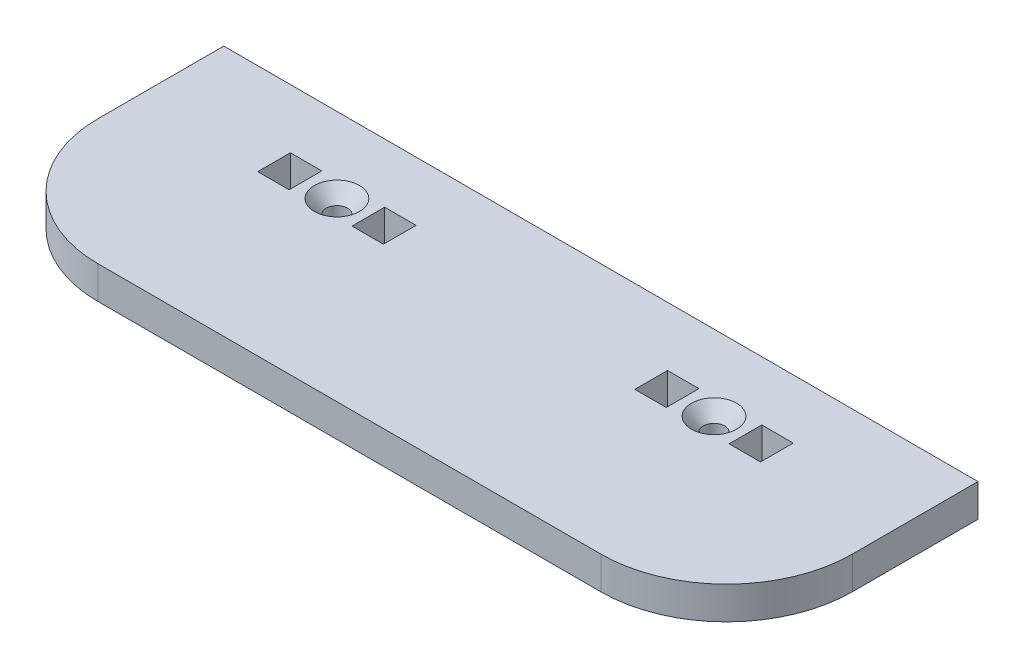
ISO-10303-21;
HEADER;
FILE_DESCRIPTION(('STEP AP214'),'2;1');
FILE_NAME('part.step','',(''),(''),'','','');
FILE_SCHEMA(('AUTOMOTIVE_DESIGN { 1 0 10303 214 1 1 1 1 }'));
ENDSEC;
DATA;
#1=APPLICATION_CONTEXT('core data for automotive mechanical design processes');
#2=APPLICATION_PROTOCOL_DEFINITION('international standard','automotive_design',2000,#1);
#3=PRODUCT_CONTEXT('',#1,'mechanical');
#4=PRODUCT('Part','Part','',(#3));
#5=PRODUCT_RELATED_PRODUCT_CATEGORY('part','',(#4));
#6=PRODUCT_DEFINITION_FORMATION('','',#4);
#7=PRODUCT_DEFINITION_CONTEXT('part definition',#1,'design');
#8=PRODUCT_DEFINITION('design','',#6,#7);
#9=PRODUCT_DEFINITION_SHAPE('','',#8);
#10=(LENGTH_UNIT() NAMED_UNIT(*) SI_UNIT(.MILLI.,.METRE.));
#11=(NAMED_UNIT(*) PLANE_ANGLE_UNIT() SI_UNIT($,.RADIAN.));
#12=(NAMED_UNIT(*) SI_UNIT($,.STERADIAN.) SOLID_ANGLE_UNIT());
#13=UNCERTAINTY_MEASURE_WITH_UNIT(LENGTH_MEASURE(1.E-05),#10,'distance_accuracy_value','');
#14=(GEOMETRIC_REPRESENTATION_CONTEXT(3) GLOBAL_UNCERTAINTY_ASSIGNED_CONTEXT((#13)) GLOBAL_UNIT_ASSIGNED_CONTEXT((#10,
#11,#12)) REPRESENTATION_CONTEXT('',''));
#15=CARTESIAN_POINT('',(0.,0.,0.));
#16=DIRECTION('',(0.,0.,1.));
#17=DIRECTION('',(1.,0.,0.));
#18=AXIS2_PLACEMENT_3D('',#15,#16,#17);
#19=CARTESIAN_POINT('',(-76.2,6.604,-25.4));
#20=DIRECTION('',(1.,0.,0.));
#21=DIRECTION('',(0.,0.,-1.));
#22=AXIS2_PLACEMENT_3D('',#19,#20,#21);
#23=PLANE('',#22);
#24=DIRECTION('',(0.,0.,1.));
#25=VECTOR('',#24,1.);
#26=CARTESIAN_POINT('',(-76.2,0.,-25.4));
#27=LINE('',#26,#25);
#28=CARTESIAN_POINT('',(-76.2,0.,-25.4));
#29=VERTEX_POINT('',#28);
#30=CARTESIAN_POINT('',(-76.2,0.,0.));
#31=VERTEX_POINT('',#30);
#32=EDGE_CURVE('E312',#29,#31,#27,.T.);
#33=ORIENTED_EDGE('',*,*,#32,.T.);
#34=DIRECTION('',(0.,-1.,0.));
#35=VECTOR('',#34,1.);
#36=CARTESIAN_POINT('',(-76.2,6.604,0.));
#37=LINE('',#36,#35);
#38=CARTESIAN_POINT('',(-76.2,6.604,0.));
#39=VERTEX_POINT('',#38);
#40=EDGE_CURVE('E11',#31,#39,#37,.F.);
#41=ORIENTED_EDGE('',*,*,#40,.T.);
#42=DIRECTION('',(0.,0.,1.));
#43=VECTOR('',#42,1.);
#44=CARTESIAN_POINT('',(-76.2,6.604,-25.4));
#45=LINE('',#44,#43);
#46=CARTESIAN_POINT('',(-76.2,6.604,-25.4));
#47=VERTEX_POINT('',#46);
#48=EDGE_CURVE('E319',#47,#39,#45,.T.);
#49=ORIENTED_EDGE('',*,*,#48,.F.);
#50=DIRECTION('',(0.,-1.,0.));
#51=VECTOR('',#50,1.);
#52=CARTESIAN_POINT('',(-76.2,6.604,-25.4));
#53=LINE('',#52,#51);
#54=EDGE_CURVE('E330',#47,#29,#53,.T.);
#55=ORIENTED_EDGE('',*,*,#54,.T.);
#56=EDGE_LOOP('',(#33,#41,#49,#55));
#57=FACE_BOUND('',#56,.T.);
#58=ADVANCED_FACE('F32',(#57),#23,.F.);
#59=CARTESIAN_POINT('',(-76.2,6.604,25.4));
#60=DIRECTION('',(0.,0.,-1.));
#61=DIRECTION('',(-1.,0.,0.));
#62=AXIS2_PLACEMENT_3D('',#59,#60,#61);
#63=PLANE('',#62);
#64=DIRECTION('',(1.,0.,0.));
#65=VECTOR('',#64,1.);
#66=CARTESIAN_POINT('',(-76.2,0.,25.4));
#67=LINE('',#66,#65);
#68=CARTESIAN_POINT('',(-50.8,0.,25.4));
#69=VERTEX_POINT('',#68);
#70=CARTESIAN_POINT('',(50.8,0.,25.4));
#71=VERTEX_POINT('',#70);
#72=EDGE_CURVE('E333',#69,#71,#67,.T.);
#73=ORIENTED_EDGE('',*,*,#72,.T.);
#74=DIRECTION('',(0.,-1.,0.));
#75=VECTOR('',#74,1.);
#76=CARTESIAN_POINT('',(50.8,6.604,25.4));
#77=LINE('',#76,#75);
#78=CARTESIAN_POINT('',(50.8,6.604,25.4));
#79=VERTEX_POINT('',#78);
#80=EDGE_CURVE('E354',#71,#79,#77,.F.);
#81=ORIENTED_EDGE('',*,*,#80,.T.);
#82=DIRECTION('',(1.,0.,0.));
#83=VECTOR('',#82,1.);
#84=CARTESIAN_POINT('',(-76.2,6.604,25.4));
#85=LINE('',#84,#83);
#86=CARTESIAN_POINT('',(-50.8,6.604,25.4));
#87=VERTEX_POINT('',#86);
#88=EDGE_CURVE('E322',#87,#79,#85,.T.);
#89=ORIENTED_EDGE('',*,*,#88,.F.);
#90=DIRECTION('',(0.,-1.,0.));
#91=VECTOR('',#90,1.);
#92=CARTESIAN_POINT('',(-50.8,6.604,25.4));
#93=LINE('',#92,#91);
#94=EDGE_CURVE('E351',#87,#69,#93,.T.);
#95=ORIENTED_EDGE('',*,*,#94,.T.);
#96=EDGE_LOOP('',(#73,#81,#89,#95));
#97=FACE_BOUND('',#96,.T.);
#98=ADVANCED_FACE('F375',(#97),#63,.F.);
#99=CARTESIAN_POINT('',(76.2,6.604,-25.4));
#100=DIRECTION('',(-1.,0.,0.));
#101=DIRECTION('',(0.,0.,1.));
#102=AXIS2_PLACEMENT_3D('',#99,#100,#101);
#103=PLANE('',#102);
#104=DIRECTION('',(0.,0.,-1.));
#105=VECTOR('',#104,1.);
#106=CARTESIAN_POINT('',(76.2,6.604,-25.4));
#107=LINE('',#106,#105);
#108=CARTESIAN_POINT('',(76.2,6.604,0.));
#109=VERTEX_POINT('',#108);
#110=CARTESIAN_POINT('',(76.2,6.604,-25.4));
#111=VERTEX_POINT('',#110);
#112=EDGE_CURVE('E326',#109,#111,#107,.T.);
#113=ORIENTED_EDGE('',*,*,#112,.F.);
#114=DIRECTION('',(0.,-1.,0.));
#115=VECTOR('',#114,1.);
#116=CARTESIAN_POINT('',(76.2,6.604,0.));
#117=LINE('',#116,#115);
#118=CARTESIAN_POINT('',(76.2,0.,0.));
#119=VERTEX_POINT('',#118);
#120=EDGE_CURVE('E344',#109,#119,#117,.T.);
#121=ORIENTED_EDGE('',*,*,#120,.T.);
#122=DIRECTION('',(0.,0.,-1.));
#123=VECTOR('',#122,1.);
#124=CARTESIAN_POINT('',(76.2,0.,-25.4));
#125=LINE('',#124,#123);
#126=CARTESIAN_POINT('',(76.2,0.,-25.4));
#127=VERTEX_POINT('',#126);
#128=EDGE_CURVE('E336',#119,#127,#125,.T.);
#129=ORIENTED_EDGE('',*,*,#128,.T.);
#130=DIRECTION('',(0.,-1.,0.));
#131=VECTOR('',#130,1.);
#132=CARTESIAN_POINT('',(76.2,6.604,-25.4));
#133=LINE('',#132,#131);
#134=EDGE_CURVE('E341',#111,#127,#133,.T.);
#135=ORIENTED_EDGE('',*,*,#134,.F.);
#136=EDGE_LOOP('',(#113,#121,#129,#135));
#137=FACE_BOUND('',#136,.T.);
#138=ADVANCED_FACE('F367',(#137),#103,.F.);
#139=CARTESIAN_POINT('',(-76.2,6.604,-25.4));
#140=DIRECTION('',(0.,0.,1.));
#141=DIRECTION('',(1.,0.,0.));
#142=AXIS2_PLACEMENT_3D('',#139,#140,#141);
#143=PLANE('',#142);
#144=DIRECTION('',(-1.,0.,0.));
#145=VECTOR('',#144,1.);
#146=CARTESIAN_POINT('',(-76.2,0.,-25.4));
#147=LINE('',#146,#145);
#148=EDGE_CURVE('E323',#127,#29,#147,.T.);
#149=ORIENTED_EDGE('',*,*,#148,.T.);
#150=ORIENTED_EDGE('',*,*,#54,.F.);
#151=DIRECTION('',(-1.,0.,0.));
#152=VECTOR('',#151,1.);
#153=CARTESIAN_POINT('',(-76.2,6.604,-25.4));
#154=LINE('',#153,#152);
#155=EDGE_CURVE('E328',#111,#47,#154,.T.);
#156=ORIENTED_EDGE('',*,*,#155,.F.);
#157=ORIENTED_EDGE('',*,*,#134,.T.);
#158=EDGE_LOOP('',(#149,#150,#156,#157));
#159=FACE_BOUND('',#158,.T.);
#160=ADVANCED_FACE('F385',(#159),#143,.F.);
#161=CARTESIAN_POINT('',(0.,6.604,0.));
#162=DIRECTION('',(0.,1.,0.));
#163=DIRECTION('',(0.,0.,1.));
#164=AXIS2_PLACEMENT_3D('',#161,#162,#163);
#165=PLANE('',#164);
#166=CARTESIAN_POINT('',(-38.1000000000001,6.604,-10.16));
#167=DIRECTION('',(0.,1.,0.));
#168=DIRECTION('',(0.,0.,1.));
#169=AXIS2_PLACEMENT_3D('',#166,#167,#168);
#170=CIRCLE('',#169,4.5593);
#171=CARTESIAN_POINT('',(-38.1000000000001,6.604,-5.6007));
#172=VERTEX_POINT('',#171);
#173=EDGE_CURVE('E494',#172,#172,#170,.T.);
#174=ORIENTED_EDGE('',*,*,#173,.F.);
#175=EDGE_LOOP('',(#174));
#176=FACE_BOUND('',#175,.T.);
#177=CARTESIAN_POINT('',(38.0999999999999,6.604,-10.16));
#178=DIRECTION('',(0.,1.,0.));
#179=DIRECTION('',(0.,0.,1.));
#180=AXIS2_PLACEMENT_3D('',#177,#178,#179);
#181=CIRCLE('',#180,4.5593);
#182=CARTESIAN_POINT('',(38.0999999999999,6.604,-5.6007));
#183=VERTEX_POINT('',#182);
#184=EDGE_CURVE('E496',#183,#183,#181,.T.);
#185=ORIENTED_EDGE('',*,*,#184,.F.);
#186=EDGE_LOOP('',(#185));
#187=FACE_BOUND('',#186,.T.);
#188=DIRECTION('',(0.,0.,1.));
#189=VECTOR('',#188,1.);
#190=CARTESIAN_POINT('',(25.3999999999999,6.604,-6.85799999999998));
#191=LINE('',#190,#189);
#192=CARTESIAN_POINT('',(25.4,6.604,-13.462));
#193=VERTEX_POINT('',#192);
#194=CARTESIAN_POINT('',(25.3999999999999,6.604,-6.85799999999998));
#195=VERTEX_POINT('',#194);
#196=EDGE_CURVE('E47',#193,#195,#191,.T.);
#197=ORIENTED_EDGE('',*,*,#196,.F.);
#198=DIRECTION('',(-1.,0.,0.));
#199=VECTOR('',#198,1.);
#200=CARTESIAN_POINT('',(25.4,6.604,-13.462));
#201=LINE('',#200,#199);
#202=CARTESIAN_POINT('',(31.75,6.604,-13.462));
#203=VERTEX_POINT('',#202);
#204=EDGE_CURVE('E198',#203,#193,#201,.T.);
#205=ORIENTED_EDGE('',*,*,#204,.F.);
#206=DIRECTION('',(0.,0.,-1.));
#207=VECTOR('',#206,1.);
#208=CARTESIAN_POINT('',(31.75,6.604,-13.462));
#209=LINE('',#208,#207);
#210=CARTESIAN_POINT('',(31.7499999999999,6.604,-6.858));
#211=VERTEX_POINT('',#210);
#212=EDGE_CURVE('E201',#211,#203,#209,.T.);
#213=ORIENTED_EDGE('',*,*,#212,.F.);
#214=DIRECTION('',(1.,0.,0.));
#215=VECTOR('',#214,1.);
#216=CARTESIAN_POINT('',(31.7499999999999,6.604,-6.858));
#217=LINE('',#216,#215);
#218=EDGE_CURVE('E210',#195,#211,#217,.T.);
#219=ORIENTED_EDGE('',*,*,#218,.F.);
#220=EDGE_LOOP('',(#197,#205,#213,#219));
#221=FACE_BOUND('',#220,.T.);
#222=DIRECTION('',(0.,0.,1.));
#223=VECTOR('',#222,1.);
#224=CARTESIAN_POINT('',(44.4499999999999,6.604,-6.85799999999998));
#225=LINE('',#224,#223);
#226=CARTESIAN_POINT('',(44.4499999999998,6.604,-13.462));
#227=VERTEX_POINT('',#226);
#228=CARTESIAN_POINT('',(44.4499999999999,6.604,-6.85799999999998));
#229=VERTEX_POINT('',#228);
#230=EDGE_CURVE('E216',#227,#229,#225,.T.);
#231=ORIENTED_EDGE('',*,*,#230,.F.);
#232=DIRECTION('',(-1.,0.,0.));
#233=VECTOR('',#232,1.);
#234=CARTESIAN_POINT('',(44.4499999999998,6.604,-13.462));
#235=LINE('',#234,#233);
#236=CARTESIAN_POINT('',(50.7999999999999,6.604,-13.462));
#237=VERTEX_POINT('',#236);
#238=EDGE_CURVE('E224',#237,#227,#235,.T.);
#239=ORIENTED_EDGE('',*,*,#238,.F.);
#240=DIRECTION('',(0.,0.,-1.));
#241=VECTOR('',#240,1.);
#242=CARTESIAN_POINT('',(50.7999999999999,6.604,-13.462));
#243=LINE('',#242,#241);
#244=CARTESIAN_POINT('',(50.7999999999999,6.604,-6.858));
#245=VERTEX_POINT('',#244);
#246=EDGE_CURVE('E238',#245,#237,#243,.T.);
#247=ORIENTED_EDGE('',*,*,#246,.F.);
#248=DIRECTION('',(1.,0.,0.));
#249=VECTOR('',#248,1.);
#250=CARTESIAN_POINT('',(50.7999999999999,6.604,-6.858));
#251=LINE('',#250,#249);
#252=EDGE_CURVE('E235',#229,#245,#251,.T.);
#253=ORIENTED_EDGE('',*,*,#252,.F.);
#254=EDGE_LOOP('',(#231,#239,#247,#253));
#255=FACE_BOUND('',#254,.T.);
#256=DIRECTION('',(0.,0.,1.));
#257=VECTOR('',#256,1.);
#258=CARTESIAN_POINT('',(-50.8000000000001,6.604,-6.85799999999998));
#259=LINE('',#258,#257);
#260=CARTESIAN_POINT('',(-50.8,6.604,-13.462));
#261=VERTEX_POINT('',#260);
#262=CARTESIAN_POINT('',(-50.8000000000001,6.604,-6.85799999999998));
#263=VERTEX_POINT('',#262);
#264=EDGE_CURVE('E254',#261,#263,#259,.T.);
#265=ORIENTED_EDGE('',*,*,#264,.F.);
#266=DIRECTION('',(-1.,0.,0.));
#267=VECTOR('',#266,1.);
#268=CARTESIAN_POINT('',(-50.8,6.604,-13.462));
#269=LINE('',#268,#267);
#270=CARTESIAN_POINT('',(-44.45,6.604,-13.462));
#271=VERTEX_POINT('',#270);
#272=EDGE_CURVE('E259',#271,#261,#269,.T.);
#273=ORIENTED_EDGE('',*,*,#272,.F.);
#274=DIRECTION('',(0.,0.,-1.));
#275=VECTOR('',#274,1.);
#276=CARTESIAN_POINT('',(-44.45,6.604,-13.462));
#277=LINE('',#276,#275);
#278=CARTESIAN_POINT('',(-44.4500000000001,6.604,-6.858));
#279=VERTEX_POINT('',#278);
#280=EDGE_CURVE('E273',#279,#271,#277,.T.);
#281=ORIENTED_EDGE('',*,*,#280,.F.);
#282=DIRECTION('',(1.,0.,0.));
#283=VECTOR('',#282,1.);
#284=CARTESIAN_POINT('',(-44.4500000000001,6.604,-6.858));
#285=LINE('',#284,#283);
#286=EDGE_CURVE('E270',#263,#279,#285,.T.);
#287=ORIENTED_EDGE('',*,*,#286,.F.);
#288=EDGE_LOOP('',(#265,#273,#281,#287));
#289=FACE_BOUND('',#288,.T.);
#290=DIRECTION('',(0.,0.,1.));
#291=VECTOR('',#290,1.);
#292=CARTESIAN_POINT('',(-31.7500000000001,6.604,-6.85799999999998));
#293=LINE('',#292,#291);
#294=CARTESIAN_POINT('',(-31.7500000000002,6.604,-13.462));
#295=VERTEX_POINT('',#294);
#296=CARTESIAN_POINT('',(-31.7500000000001,6.604,-6.85799999999998));
#297=VERTEX_POINT('',#296);
#298=EDGE_CURVE('E280',#295,#297,#293,.T.);
#299=ORIENTED_EDGE('',*,*,#298,.F.);
#300=DIRECTION('',(-1.,0.,0.));
#301=VECTOR('',#300,1.);
#302=CARTESIAN_POINT('',(-31.7500000000002,6.604,-13.462));
#303=LINE('',#302,#301);
#304=CARTESIAN_POINT('',(-25.4000000000001,6.604,-13.462));
#305=VERTEX_POINT('',#304);
#306=EDGE_CURVE('E291',#305,#295,#303,.T.);
#307=ORIENTED_EDGE('',*,*,#306,.F.);
#308=DIRECTION('',(0.,0.,-1.));
#309=VECTOR('',#308,1.);
#310=CARTESIAN_POINT('',(-25.4000000000001,6.604,-13.462));
#311=LINE('',#310,#309);
#312=CARTESIAN_POINT('',(-25.4000000000001,6.604,-6.858));
#313=VERTEX_POINT('',#312);
#314=EDGE_CURVE('E305',#313,#305,#311,.T.);
#315=ORIENTED_EDGE('',*,*,#314,.F.);
#316=DIRECTION('',(1.,0.,0.));
#317=VECTOR('',#316,1.);
#318=CARTESIAN_POINT('',(-25.4000000000001,6.604,-6.858));
#319=LINE('',#318,#317);
#320=EDGE_CURVE('E302',#297,#313,#319,.T.);
#321=ORIENTED_EDGE('',*,*,#320,.F.);
#322=EDGE_LOOP('',(#299,#307,#315,#321));
#323=FACE_BOUND('',#322,.T.);
#324=ORIENTED_EDGE('',*,*,#88,.T.);
#325=CARTESIAN_POINT('',(50.8,6.604,0.));
#326=DIRECTION('',(0.,1.,0.));
#327=DIRECTION('',(0.,0.,1.));
#328=AXIS2_PLACEMENT_3D('',#325,#326,#327);
#329=CIRCLE('',#328,25.4);
#330=EDGE_CURVE('E40',#79,#109,#329,.T.);
#331=ORIENTED_EDGE('',*,*,#330,.T.);
#332=ORIENTED_EDGE('',*,*,#112,.T.);
#333=ORIENTED_EDGE('',*,*,#155,.T.);
#334=ORIENTED_EDGE('',*,*,#48,.T.);
#335=CARTESIAN_POINT('',(-50.8,6.604,0.));
#336=DIRECTION('',(0.,1.,0.));
#337=DIRECTION('',(0.,0.,1.));
#338=AXIS2_PLACEMENT_3D('',#335,#336,#337);
#339=CIRCLE('',#338,25.4);
#340=EDGE_CURVE('E356',#39,#87,#339,.T.);
#341=ORIENTED_EDGE('',*,*,#340,.T.);
#342=EDGE_LOOP('',(#324,#331,#332,#333,#334,#341));
#343=FACE_BOUND('',#342,.T.);
#344=ADVANCED_FACE('F360',(#176,#187,#221,#255,#289,#323,#343),#165,.T.);
#345=CARTESIAN_POINT('',(0.,0.,0.));
#346=DIRECTION('',(0.,1.,0.));
#347=DIRECTION('',(0.,0.,1.));
#348=AXIS2_PLACEMENT_3D('',#345,#346,#347);
#349=PLANE('',#348);
#350=CARTESIAN_POINT('',(38.0999999999999,0.,-10.16));
#351=DIRECTION('',(0.,1.,0.));
#352=DIRECTION('',(0.,0.,1.));
#353=AXIS2_PLACEMENT_3D('',#350,#351,#352);
#354=CIRCLE('',#353,2.15265);
#355=CARTESIAN_POINT('',(38.0999999999999,0.,-8.00735000000001));
#356=VERTEX_POINT('',#355);
#357=EDGE_CURVE('E204',#356,#356,#354,.T.);
#358=ORIENTED_EDGE('',*,*,#357,.T.);
#359=EDGE_LOOP('',(#358));
#360=FACE_BOUND('',#359,.T.);
#361=DIRECTION('',(-1.,0.,0.));
#362=VECTOR('',#361,1.);
#363=CARTESIAN_POINT('',(25.4,0.,-13.462));
#364=LINE('',#363,#362);
#365=CARTESIAN_POINT('',(31.75,0.,-13.462));
#366=VERTEX_POINT('',#365);
#367=CARTESIAN_POINT('',(25.4,0.,-13.462));
#368=VERTEX_POINT('',#367);
#369=EDGE_CURVE('E188',#366,#368,#364,.T.);
#370=ORIENTED_EDGE('',*,*,#369,.T.);
#371=DIRECTION('',(0.,0.,1.));
#372=VECTOR('',#371,1.);
#373=CARTESIAN_POINT('',(25.3999999999999,0.,-6.85799999999998));
#374=LINE('',#373,#372);
#375=CARTESIAN_POINT('',(25.3999999999999,0.,-6.85799999999998));
#376=VERTEX_POINT('',#375);
#377=EDGE_CURVE('E182',#368,#376,#374,.T.);
#378=ORIENTED_EDGE('',*,*,#377,.T.);
#379=DIRECTION('',(1.,0.,0.));
#380=VECTOR('',#379,1.);
#381=CARTESIAN_POINT('',(31.7499999999999,0.,-6.858));
#382=LINE('',#381,#380);
#383=CARTESIAN_POINT('',(31.7499999999999,0.,-6.858));
#384=VERTEX_POINT('',#383);
#385=EDGE_CURVE('E191',#376,#384,#382,.T.);
#386=ORIENTED_EDGE('',*,*,#385,.T.);
#387=DIRECTION('',(0.,0.,-1.));
#388=VECTOR('',#387,1.);
#389=CARTESIAN_POINT('',(31.75,0.,-13.462));
#390=LINE('',#389,#388);
#391=EDGE_CURVE('E55',#384,#366,#390,.T.);
#392=ORIENTED_EDGE('',*,*,#391,.T.);
#393=EDGE_LOOP('',(#370,#378,#386,#392));
#394=FACE_BOUND('',#393,.T.);
#395=DIRECTION('',(-1.,0.,0.));
#396=VECTOR('',#395,1.);
#397=CARTESIAN_POINT('',(44.4499999999998,0.,-13.462));
#398=LINE('',#397,#396);
#399=CARTESIAN_POINT('',(50.7999999999999,0.,-13.462));
#400=VERTEX_POINT('',#399);
#401=CARTESIAN_POINT('',(44.4499999999998,0.,-13.462));
#402=VERTEX_POINT('',#401);
#403=EDGE_CURVE('E230',#400,#402,#398,.T.);
#404=ORIENTED_EDGE('',*,*,#403,.T.);
#405=DIRECTION('',(0.,0.,1.));
#406=VECTOR('',#405,1.);
#407=CARTESIAN_POINT('',(44.4499999999999,0.,-6.85799999999998));
#408=LINE('',#407,#406);
#409=CARTESIAN_POINT('',(44.4499999999999,0.,-6.85799999999998));
#410=VERTEX_POINT('',#409);
#411=EDGE_CURVE('E220',#402,#410,#408,.T.);
#412=ORIENTED_EDGE('',*,*,#411,.T.);
#413=DIRECTION('',(1.,0.,0.));
#414=VECTOR('',#413,1.);
#415=CARTESIAN_POINT('',(50.7999999999999,0.,-6.858));
#416=LINE('',#415,#414);
#417=CARTESIAN_POINT('',(50.7999999999999,0.,-6.858));
#418=VERTEX_POINT('',#417);
#419=EDGE_CURVE('E223',#410,#418,#416,.T.);
#420=ORIENTED_EDGE('',*,*,#419,.T.);
#421=DIRECTION('',(0.,0.,-1.));
#422=VECTOR('',#421,1.);
#423=CARTESIAN_POINT('',(50.7999999999999,0.,-13.462));
#424=LINE('',#423,#422);
#425=EDGE_CURVE('E227',#418,#400,#424,.T.);
#426=ORIENTED_EDGE('',*,*,#425,.T.);
#427=EDGE_LOOP('',(#404,#412,#420,#426));
#428=FACE_BOUND('',#427,.T.);
#429=CARTESIAN_POINT('',(-38.1000000000001,0.,-10.16));
#430=DIRECTION('',(0.,1.,0.));
#431=DIRECTION('',(0.,0.,1.));
#432=AXIS2_PLACEMENT_3D('',#429,#430,#431);
#433=CIRCLE('',#432,2.15265);
#434=CARTESIAN_POINT('',(-38.1000000000001,0.,-8.00735000000001));
#435=VERTEX_POINT('',#434);
#436=EDGE_CURVE('E245',#435,#435,#433,.T.);
#437=ORIENTED_EDGE('',*,*,#436,.T.);
#438=EDGE_LOOP('',(#437));
#439=FACE_BOUND('',#438,.T.);
#440=DIRECTION('',(-1.,0.,0.));
#441=VECTOR('',#440,1.);
#442=CARTESIAN_POINT('',(-50.8,0.,-13.462));
#443=LINE('',#442,#441);
#444=CARTESIAN_POINT('',(-44.45,0.,-13.462));
#445=VERTEX_POINT('',#444);
#446=CARTESIAN_POINT('',(-50.8,0.,-13.462));
#447=VERTEX_POINT('',#446);
#448=EDGE_CURVE('E265',#445,#447,#443,.T.);
#449=ORIENTED_EDGE('',*,*,#448,.T.);
#450=DIRECTION('',(0.,0.,1.));
#451=VECTOR('',#450,1.);
#452=CARTESIAN_POINT('',(-50.8000000000001,0.,-6.85799999999998));
#453=LINE('',#452,#451);
#454=CARTESIAN_POINT('',(-50.8000000000001,0.,-6.85799999999998));
#455=VERTEX_POINT('',#454);
#456=EDGE_CURVE('E255',#447,#455,#453,.T.);
#457=ORIENTED_EDGE('',*,*,#456,.T.);
#458=DIRECTION('',(1.,0.,0.));
#459=VECTOR('',#458,1.);
#460=CARTESIAN_POINT('',(-44.4500000000001,0.,-6.858));
#461=LINE('',#460,#459);
#462=CARTESIAN_POINT('',(-44.4500000000001,0.,-6.858));
#463=VERTEX_POINT('',#462);
#464=EDGE_CURVE('E258',#455,#463,#461,.T.);
#465=ORIENTED_EDGE('',*,*,#464,.T.);
#466=DIRECTION('',(0.,0.,-1.));
#467=VECTOR('',#466,1.);
#468=CARTESIAN_POINT('',(-44.45,0.,-13.462));
#469=LINE('',#468,#467);
#470=EDGE_CURVE('E262',#463,#445,#469,.T.);
#471=ORIENTED_EDGE('',*,*,#470,.T.);
#472=EDGE_LOOP('',(#449,#457,#465,#471));
#473=FACE_BOUND('',#472,.T.);
#474=DIRECTION('',(-1.,0.,0.));
#475=VECTOR('',#474,1.);
#476=CARTESIAN_POINT('',(-31.7500000000002,0.,-13.462));
#477=LINE('',#476,#475);
#478=CARTESIAN_POINT('',(-25.4000000000001,0.,-13.462));
#479=VERTEX_POINT('',#478);
#480=CARTESIAN_POINT('',(-31.7500000000002,0.,-13.462));
#481=VERTEX_POINT('',#480);
#482=EDGE_CURVE('E297',#479,#481,#477,.T.);
#483=ORIENTED_EDGE('',*,*,#482,.T.);
#484=DIRECTION('',(0.,0.,1.));
#485=VECTOR('',#484,1.);
#486=CARTESIAN_POINT('',(-31.7500000000001,0.,-6.85799999999998));
#487=LINE('',#486,#485);
#488=CARTESIAN_POINT('',(-31.7500000000001,0.,-6.85799999999998));
#489=VERTEX_POINT('',#488);
#490=EDGE_CURVE('E287',#481,#489,#487,.T.);
#491=ORIENTED_EDGE('',*,*,#490,.T.);
#492=DIRECTION('',(1.,0.,0.));
#493=VECTOR('',#492,1.);
#494=CARTESIAN_POINT('',(-25.4000000000001,0.,-6.858));
#495=LINE('',#494,#493);
#496=CARTESIAN_POINT('',(-25.4000000000001,0.,-6.858));
#497=VERTEX_POINT('',#496);
#498=EDGE_CURVE('E290',#489,#497,#495,.T.);
#499=ORIENTED_EDGE('',*,*,#498,.T.);
#500=DIRECTION('',(0.,0.,-1.));
#501=VECTOR('',#500,1.);
#502=CARTESIAN_POINT('',(-25.4000000000001,0.,-13.462));
#503=LINE('',#502,#501);
#504=EDGE_CURVE('E294',#497,#479,#503,.T.);
#505=ORIENTED_EDGE('',*,*,#504,.T.);
#506=EDGE_LOOP('',(#483,#491,#499,#505));
#507=FACE_BOUND('',#506,.T.);
#508=ORIENTED_EDGE('',*,*,#128,.F.);
#509=CARTESIAN_POINT('',(50.8,0.,0.));
#510=DIRECTION('',(0.,1.,0.));
#511=DIRECTION('',(0.,0.,1.));
#512=AXIS2_PLACEMENT_3D('',#509,#510,#511);
#513=CIRCLE('',#512,25.4);
#514=EDGE_CURVE('E349',#119,#71,#513,.F.);
#515=ORIENTED_EDGE('',*,*,#514,.T.);
#516=ORIENTED_EDGE('',*,*,#72,.F.);
#517=CARTESIAN_POINT('',(-50.8,0.,0.));
#518=DIRECTION('',(0.,1.,0.));
#519=DIRECTION('',(0.,0.,1.));
#520=AXIS2_PLACEMENT_3D('',#517,#518,#519);
#521=CIRCLE('',#520,25.4);
#522=EDGE_CURVE('E347',#69,#31,#521,.F.);
#523=ORIENTED_EDGE('',*,*,#522,.T.);
#524=ORIENTED_EDGE('',*,*,#32,.F.);
#525=ORIENTED_EDGE('',*,*,#148,.F.);
#526=EDGE_LOOP('',(#508,#515,#516,#523,#524,#525));
#527=FACE_BOUND('',#526,.T.);
#528=ADVANCED_FACE('F195',(#360,#394,#428,#439,#473,#507,#527),#349,.F.);
#529=CARTESIAN_POINT('',(50.8,6.604,0.));
#530=DIRECTION('',(0.,-1.,0.));
#531=DIRECTION('',(0.,0.,-1.));
#532=AXIS2_PLACEMENT_3D('',#529,#530,#531);
#533=CYLINDRICAL_SURFACE('',#532,25.4);
#534=ORIENTED_EDGE('',*,*,#330,.F.);
#535=ORIENTED_EDGE('',*,*,#80,.F.);
#536=ORIENTED_EDGE('',*,*,#514,.F.);
#537=ORIENTED_EDGE('',*,*,#120,.F.);
#538=EDGE_LOOP('',(#534,#535,#536,#537));
#539=FACE_BOUND('',#538,.T.);
#540=ADVANCED_FACE('F370',(#539),#533,.T.);
#541=CARTESIAN_POINT('',(-50.8,6.604,0.));
#542=DIRECTION('',(0.,-1.,0.));
#543=DIRECTION('',(0.,0.,-1.));
#544=AXIS2_PLACEMENT_3D('',#541,#542,#543);
#545=CYLINDRICAL_SURFACE('',#544,25.4);
#546=ORIENTED_EDGE('',*,*,#340,.F.);
#547=ORIENTED_EDGE('',*,*,#40,.F.);
#548=ORIENTED_EDGE('',*,*,#522,.F.);
#549=ORIENTED_EDGE('',*,*,#94,.F.);
#550=EDGE_LOOP('',(#546,#547,#548,#549));
#551=FACE_BOUND('',#550,.T.);
#552=ADVANCED_FACE('F34',(#551),#545,.T.);
#553=CARTESIAN_POINT('',(-31.7500000000001,0.,-6.85799999999998));
#554=DIRECTION('',(-1.,0.,0.));
#555=DIRECTION('',(0.,0.,1.));
#556=AXIS2_PLACEMENT_3D('',#553,#554,#555);
#557=PLANE('',#556);
#558=ORIENTED_EDGE('',*,*,#298,.T.);
#559=DIRECTION('',(0.,1.,0.));
#560=VECTOR('',#559,1.);
#561=CARTESIAN_POINT('',(-31.7500000000001,0.,-6.85799999999998));
#562=LINE('',#561,#560);
#563=EDGE_CURVE('E300',#489,#297,#562,.T.);
#564=ORIENTED_EDGE('',*,*,#563,.F.);
#565=ORIENTED_EDGE('',*,*,#490,.F.);
#566=DIRECTION('',(0.,1.,0.));
#567=VECTOR('',#566,1.);
#568=CARTESIAN_POINT('',(-31.7500000000002,0.,-13.462));
#569=LINE('',#568,#567);
#570=EDGE_CURVE('E310',#481,#295,#569,.T.);
#571=ORIENTED_EDGE('',*,*,#570,.T.);
#572=EDGE_LOOP('',(#558,#564,#565,#571));
#573=FACE_BOUND('',#572,.T.);
#574=ADVANCED_FACE('F407',(#573),#557,.F.);
#575=CARTESIAN_POINT('',(-31.7500000000002,0.,-13.462));
#576=DIRECTION('',(0.,0.,-1.));
#577=DIRECTION('',(-1.,0.,0.));
#578=AXIS2_PLACEMENT_3D('',#575,#576,#577);
#579=PLANE('',#578);
#580=ORIENTED_EDGE('',*,*,#306,.T.);
#581=ORIENTED_EDGE('',*,*,#570,.F.);
#582=ORIENTED_EDGE('',*,*,#482,.F.);
#583=DIRECTION('',(0.,1.,0.));
#584=VECTOR('',#583,1.);
#585=CARTESIAN_POINT('',(-25.4000000000001,0.,-13.462));
#586=LINE('',#585,#584);
#587=EDGE_CURVE('E313',#479,#305,#586,.T.);
#588=ORIENTED_EDGE('',*,*,#587,.T.);
#589=EDGE_LOOP('',(#580,#581,#582,#588));
#590=FACE_BOUND('',#589,.T.);
#591=ADVANCED_FACE('F415',(#590),#579,.F.);
#592=CARTESIAN_POINT('',(-25.4000000000001,0.,-13.462));
#593=DIRECTION('',(1.,0.,0.));
#594=DIRECTION('',(0.,0.,-1.));
#595=AXIS2_PLACEMENT_3D('',#592,#593,#594);
#596=PLANE('',#595);
#597=ORIENTED_EDGE('',*,*,#314,.T.);
#598=ORIENTED_EDGE('',*,*,#587,.F.);
#599=ORIENTED_EDGE('',*,*,#504,.F.);
#600=DIRECTION('',(0.,1.,0.));
#601=VECTOR('',#600,1.);
#602=CARTESIAN_POINT('',(-25.4000000000001,0.,-6.858));
#603=LINE('',#602,#601);
#604=EDGE_CURVE('E315',#497,#313,#603,.T.);
#605=ORIENTED_EDGE('',*,*,#604,.T.);
#606=EDGE_LOOP('',(#597,#598,#599,#605));
#607=FACE_BOUND('',#606,.T.);
#608=ADVANCED_FACE('F421',(#607),#596,.F.);
#609=CARTESIAN_POINT('',(-25.4000000000001,0.,-6.858));
#610=DIRECTION('',(0.,0.,1.));
#611=DIRECTION('',(1.,0.,0.));
#612=AXIS2_PLACEMENT_3D('',#609,#610,#611);
#613=PLANE('',#612);
#614=ORIENTED_EDGE('',*,*,#320,.T.);
#615=ORIENTED_EDGE('',*,*,#604,.F.);
#616=ORIENTED_EDGE('',*,*,#498,.F.);
#617=ORIENTED_EDGE('',*,*,#563,.T.);
#618=EDGE_LOOP('',(#614,#615,#616,#617));
#619=FACE_BOUND('',#618,.T.);
#620=ADVANCED_FACE('F417',(#619),#613,.F.);
#621=CARTESIAN_POINT('',(-50.8000000000001,0.,-6.85799999999998));
#622=DIRECTION('',(-1.,0.,0.));
#623=DIRECTION('',(0.,0.,1.));
#624=AXIS2_PLACEMENT_3D('',#621,#622,#623);
#625=PLANE('',#624);
#626=ORIENTED_EDGE('',*,*,#264,.T.);
#627=DIRECTION('',(0.,1.,0.));
#628=VECTOR('',#627,1.);
#629=CARTESIAN_POINT('',(-50.8000000000001,0.,-6.85799999999998));
#630=LINE('',#629,#628);
#631=EDGE_CURVE('E268',#455,#263,#630,.T.);
#632=ORIENTED_EDGE('',*,*,#631,.F.);
#633=ORIENTED_EDGE('',*,*,#456,.F.);
#634=DIRECTION('',(0.,1.,0.));
#635=VECTOR('',#634,1.);
#636=CARTESIAN_POINT('',(-50.8,0.,-13.462));
#637=LINE('',#636,#635);
#638=EDGE_CURVE('E278',#447,#261,#637,.T.);
#639=ORIENTED_EDGE('',*,*,#638,.T.);
#640=EDGE_LOOP('',(#626,#632,#633,#639));
#641=FACE_BOUND('',#640,.T.);
#642=ADVANCED_FACE('F420',(#641),#625,.F.);
#643=CARTESIAN_POINT('',(-50.8,0.,-13.462));
#644=DIRECTION('',(0.,0.,-1.));
#645=DIRECTION('',(-1.,0.,0.));
#646=AXIS2_PLACEMENT_3D('',#643,#644,#645);
#647=PLANE('',#646);
#648=ORIENTED_EDGE('',*,*,#272,.T.);
#649=ORIENTED_EDGE('',*,*,#638,.F.);
#650=ORIENTED_EDGE('',*,*,#448,.F.);
#651=DIRECTION('',(0.,1.,0.));
#652=VECTOR('',#651,1.);
#653=CARTESIAN_POINT('',(-44.45,0.,-13.462));
#654=LINE('',#653,#652);
#655=EDGE_CURVE('E281',#445,#271,#654,.T.);
#656=ORIENTED_EDGE('',*,*,#655,.T.);
#657=EDGE_LOOP('',(#648,#649,#650,#656));
#658=FACE_BOUND('',#657,.T.);
#659=ADVANCED_FACE('F431',(#658),#647,.F.);
#660=CARTESIAN_POINT('',(-44.45,0.,-13.462));
#661=DIRECTION('',(1.,0.,0.));
#662=DIRECTION('',(0.,0.,-1.));
#663=AXIS2_PLACEMENT_3D('',#660,#661,#662);
#664=PLANE('',#663);
#665=ORIENTED_EDGE('',*,*,#280,.T.);
#666=ORIENTED_EDGE('',*,*,#655,.F.);
#667=ORIENTED_EDGE('',*,*,#470,.F.);
#668=DIRECTION('',(0.,1.,0.));
#669=VECTOR('',#668,1.);
#670=CARTESIAN_POINT('',(-44.4500000000001,0.,-6.858));
#671=LINE('',#670,#669);
#672=EDGE_CURVE('E283',#463,#279,#671,.T.);
#673=ORIENTED_EDGE('',*,*,#672,.T.);
#674=EDGE_LOOP('',(#665,#666,#667,#673));
#675=FACE_BOUND('',#674,.T.);
#676=ADVANCED_FACE('F437',(#675),#664,.F.);
#677=CARTESIAN_POINT('',(-44.4500000000001,0.,-6.858));
#678=DIRECTION('',(0.,0.,1.));
#679=DIRECTION('',(1.,0.,0.));
#680=AXIS2_PLACEMENT_3D('',#677,#678,#679);
#681=PLANE('',#680);
#682=ORIENTED_EDGE('',*,*,#286,.T.);
#683=ORIENTED_EDGE('',*,*,#672,.F.);
#684=ORIENTED_EDGE('',*,*,#464,.F.);
#685=ORIENTED_EDGE('',*,*,#631,.T.);
#686=EDGE_LOOP('',(#682,#683,#684,#685));
#687=FACE_BOUND('',#686,.T.);
#688=ADVANCED_FACE('F433',(#687),#681,.F.);
#689=CARTESIAN_POINT('',(-38.1000000000001,0.,-10.16));
#690=DIRECTION('',(0.,1.,0.));
#691=DIRECTION('',(0.,0.,1.));
#692=AXIS2_PLACEMENT_3D('',#689,#690,#691);
#693=CYLINDRICAL_SURFACE('',#692,2.15265);
#694=CARTESIAN_POINT('',(-38.1000000000001,3.83546587276156,-10.16));
#695=DIRECTION('',(0.,1.,0.));
#696=DIRECTION('',(0.,0.,1.));
#697=AXIS2_PLACEMENT_3D('',#694,#695,#696);
#698=CIRCLE('',#697,2.15265);
#699=CARTESIAN_POINT('',(-38.1000000000001,3.83546587276156,-8.00735000000001));
#700=VERTEX_POINT('',#699);
#701=EDGE_CURVE('E491',#700,#700,#698,.T.);
#702=ORIENTED_EDGE('',*,*,#701,.T.);
#703=EDGE_LOOP('',(#702));
#704=FACE_BOUND('',#703,.T.);
#705=ORIENTED_EDGE('',*,*,#436,.F.);
#706=EDGE_LOOP('',(#705));
#707=FACE_BOUND('',#706,.T.);
#708=ADVANCED_FACE('F436',(#704,#707),#693,.F.);
#709=CARTESIAN_POINT('',(44.4499999999999,0.,-6.85799999999998));
#710=DIRECTION('',(-1.,0.,0.));
#711=DIRECTION('',(0.,0.,1.));
#712=AXIS2_PLACEMENT_3D('',#709,#710,#711);
#713=PLANE('',#712);
#714=ORIENTED_EDGE('',*,*,#230,.T.);
#715=DIRECTION('',(0.,1.,0.));
#716=VECTOR('',#715,1.);
#717=CARTESIAN_POINT('',(44.4499999999999,0.,-6.85799999999998));
#718=LINE('',#717,#716);
#719=EDGE_CURVE('E233',#410,#229,#718,.T.);
#720=ORIENTED_EDGE('',*,*,#719,.F.);
#721=ORIENTED_EDGE('',*,*,#411,.F.);
#722=DIRECTION('',(0.,1.,0.));
#723=VECTOR('',#722,1.);
#724=CARTESIAN_POINT('',(44.4499999999998,0.,-13.462));
#725=LINE('',#724,#723);
#726=EDGE_CURVE('E243',#402,#227,#725,.T.);
#727=ORIENTED_EDGE('',*,*,#726,.T.);
#728=EDGE_LOOP('',(#714,#720,#721,#727));
#729=FACE_BOUND('',#728,.T.);
#730=ADVANCED_FACE('F447',(#729),#713,.F.);
#731=CARTESIAN_POINT('',(44.4499999999998,0.,-13.462));
#732=DIRECTION('',(0.,0.,-1.));
#733=DIRECTION('',(-1.,0.,0.));
#734=AXIS2_PLACEMENT_3D('',#731,#732,#733);
#735=PLANE('',#734);
#736=ORIENTED_EDGE('',*,*,#238,.T.);
#737=ORIENTED_EDGE('',*,*,#726,.F.);
#738=ORIENTED_EDGE('',*,*,#403,.F.);
#739=DIRECTION('',(0.,1.,0.));
#740=VECTOR('',#739,1.);
#741=CARTESIAN_POINT('',(50.7999999999999,0.,-13.462));
#742=LINE('',#741,#740);
#743=EDGE_CURVE('E246',#400,#237,#742,.T.);
#744=ORIENTED_EDGE('',*,*,#743,.T.);
#745=EDGE_LOOP('',(#736,#737,#738,#744));
#746=FACE_BOUND('',#745,.T.);
#747=ADVANCED_FACE('F451',(#746),#735,.F.);
#748=CARTESIAN_POINT('',(50.7999999999999,0.,-13.462));
#749=DIRECTION('',(1.,0.,0.));
#750=DIRECTION('',(0.,0.,-1.));
#751=AXIS2_PLACEMENT_3D('',#748,#749,#750);
#752=PLANE('',#751);
#753=ORIENTED_EDGE('',*,*,#246,.T.);
#754=ORIENTED_EDGE('',*,*,#743,.F.);
#755=ORIENTED_EDGE('',*,*,#425,.F.);
#756=DIRECTION('',(0.,1.,0.));
#757=VECTOR('',#756,1.);
#758=CARTESIAN_POINT('',(50.7999999999999,0.,-6.858));
#759=LINE('',#758,#757);
#760=EDGE_CURVE('E248',#418,#245,#759,.T.);
#761=ORIENTED_EDGE('',*,*,#760,.T.);
#762=EDGE_LOOP('',(#753,#754,#755,#761));
#763=FACE_BOUND('',#762,.T.);
#764=ADVANCED_FACE('F456',(#763),#752,.F.);
#765=CARTESIAN_POINT('',(50.7999999999999,0.,-6.858));
#766=DIRECTION('',(0.,0.,1.));
#767=DIRECTION('',(1.,0.,0.));
#768=AXIS2_PLACEMENT_3D('',#765,#766,#767);
#769=PLANE('',#768);
#770=ORIENTED_EDGE('',*,*,#252,.T.);
#771=ORIENTED_EDGE('',*,*,#760,.F.);
#772=ORIENTED_EDGE('',*,*,#419,.F.);
#773=ORIENTED_EDGE('',*,*,#719,.T.);
#774=EDGE_LOOP('',(#770,#771,#772,#773));
#775=FACE_BOUND('',#774,.T.);
#776=ADVANCED_FACE('F453',(#775),#769,.F.);
#777=CARTESIAN_POINT('',(25.3999999999999,0.,-6.85799999999998));
#778=DIRECTION('',(-1.,0.,0.));
#779=DIRECTION('',(0.,0.,1.));
#780=AXIS2_PLACEMENT_3D('',#777,#778,#779);
#781=PLANE('',#780);
#782=ORIENTED_EDGE('',*,*,#196,.T.);
#783=DIRECTION('',(0.,1.,0.));
#784=VECTOR('',#783,1.);
#785=CARTESIAN_POINT('',(25.3999999999999,0.,-6.85799999999998));
#786=LINE('',#785,#784);
#787=EDGE_CURVE('E178',#376,#195,#786,.T.);
#788=ORIENTED_EDGE('',*,*,#787,.F.);
#789=ORIENTED_EDGE('',*,*,#377,.F.);
#790=DIRECTION('',(0.,1.,0.));
#791=VECTOR('',#790,1.);
#792=CARTESIAN_POINT('',(25.4,0.,-13.462));
#793=LINE('',#792,#791);
#794=EDGE_CURVE('E214',#368,#193,#793,.T.);
#795=ORIENTED_EDGE('',*,*,#794,.T.);
#796=EDGE_LOOP('',(#782,#788,#789,#795));
#797=FACE_BOUND('',#796,.T.);
#798=ADVANCED_FACE('F180',(#797),#781,.F.);
#799=CARTESIAN_POINT('',(25.4,0.,-13.462));
#800=DIRECTION('',(0.,0.,-1.));
#801=DIRECTION('',(-1.,0.,0.));
#802=AXIS2_PLACEMENT_3D('',#799,#800,#801);
#803=PLANE('',#802);
#804=ORIENTED_EDGE('',*,*,#204,.T.);
#805=ORIENTED_EDGE('',*,*,#794,.F.);
#806=ORIENTED_EDGE('',*,*,#369,.F.);
#807=DIRECTION('',(0.,1.,0.));
#808=VECTOR('',#807,1.);
#809=CARTESIAN_POINT('',(31.75,0.,-13.462));
#810=LINE('',#809,#808);
#811=EDGE_CURVE('E217',#366,#203,#810,.T.);
#812=ORIENTED_EDGE('',*,*,#811,.T.);
#813=EDGE_LOOP('',(#804,#805,#806,#812));
#814=FACE_BOUND('',#813,.T.);
#815=ADVANCED_FACE('F466',(#814),#803,.F.);
#816=CARTESIAN_POINT('',(31.75,0.,-13.462));
#817=DIRECTION('',(1.,0.,0.));
#818=DIRECTION('',(0.,0.,-1.));
#819=AXIS2_PLACEMENT_3D('',#816,#817,#818);
#820=PLANE('',#819);
#821=ORIENTED_EDGE('',*,*,#212,.T.);
#822=ORIENTED_EDGE('',*,*,#811,.F.);
#823=ORIENTED_EDGE('',*,*,#391,.F.);
#824=DIRECTION('',(0.,1.,0.));
#825=VECTOR('',#824,1.);
#826=CARTESIAN_POINT('',(31.7499999999999,0.,-6.858));
#827=LINE('',#826,#825);
#828=EDGE_CURVE('E187',#384,#211,#827,.T.);
#829=ORIENTED_EDGE('',*,*,#828,.T.);
#830=EDGE_LOOP('',(#821,#822,#823,#829));
#831=FACE_BOUND('',#830,.T.);
#832=ADVANCED_FACE('F470',(#831),#820,.F.);
#833=CARTESIAN_POINT('',(31.7499999999999,0.,-6.858));
#834=DIRECTION('',(0.,0.,1.));
#835=DIRECTION('',(1.,0.,0.));
#836=AXIS2_PLACEMENT_3D('',#833,#834,#835);
#837=PLANE('',#836);
#838=ORIENTED_EDGE('',*,*,#218,.T.);
#839=ORIENTED_EDGE('',*,*,#828,.F.);
#840=ORIENTED_EDGE('',*,*,#385,.F.);
#841=ORIENTED_EDGE('',*,*,#787,.T.);
#842=EDGE_LOOP('',(#838,#839,#840,#841));
#843=FACE_BOUND('',#842,.T.);
#844=ADVANCED_FACE('F192',(#843),#837,.F.);
#845=CARTESIAN_POINT('',(38.0999999999999,0.,-10.16));
#846=DIRECTION('',(0.,1.,0.));
#847=DIRECTION('',(0.,0.,1.));
#848=AXIS2_PLACEMENT_3D('',#845,#846,#847);
#849=CYLINDRICAL_SURFACE('',#848,2.15265);
#850=CARTESIAN_POINT('',(38.0999999999999,3.83546587276156,-10.16));
#851=DIRECTION('',(0.,1.,0.));
#852=DIRECTION('',(0.,0.,1.));
#853=AXIS2_PLACEMENT_3D('',#850,#851,#852);
#854=CIRCLE('',#853,2.15265);
#855=CARTESIAN_POINT('',(38.0999999999999,3.83546587276156,-8.00735000000001));
#856=VERTEX_POINT('',#855);
#857=EDGE_CURVE('E500',#856,#856,#854,.T.);
#858=ORIENTED_EDGE('',*,*,#857,.T.);
#859=EDGE_LOOP('',(#858));
#860=FACE_BOUND('',#859,.T.);
#861=ORIENTED_EDGE('',*,*,#357,.F.);
#862=EDGE_LOOP('',(#861));
#863=FACE_BOUND('',#862,.T.);
#864=ADVANCED_FACE('F469',(#860,#863),#849,.F.);
#865=CARTESIAN_POINT('',(38.0999999999999,6.604,-10.16));
#866=DIRECTION('',(0.,1.,0.));
#867=DIRECTION('',(0.,0.,1.));
#868=AXIS2_PLACEMENT_3D('',#865,#866,#867);
#869=CONICAL_SURFACE('',#868,4.5593,0.715584993317676);
#870=ORIENTED_EDGE('',*,*,#857,.F.);
#871=EDGE_LOOP('',(#870));
#872=FACE_BOUND('',#871,.T.);
#873=ORIENTED_EDGE('',*,*,#184,.T.);
#874=EDGE_LOOP('',(#873));
#875=FACE_BOUND('',#874,.T.);
#876=ADVANCED_FACE('F478',(#872,#875),#869,.F.);
#877=CARTESIAN_POINT('',(-38.1000000000001,6.604,-10.16));
#878=DIRECTION('',(0.,1.,0.));
#879=DIRECTION('',(0.,0.,1.));
#880=AXIS2_PLACEMENT_3D('',#877,#878,#879);
#881=CONICAL_SURFACE('',#880,4.5593,0.715584993317676);
#882=ORIENTED_EDGE('',*,*,#701,.F.);
#883=EDGE_LOOP('',(#882));
#884=FACE_BOUND('',#883,.T.);
#885=ORIENTED_EDGE('',*,*,#173,.T.);
#886=EDGE_LOOP('',(#885));
#887=FACE_BOUND('',#886,.T.);
#888=ADVANCED_FACE('F482',(#884,#887),#881,.F.);
#889=CLOSED_SHELL('',(#58,#98,#138,#160,#344,#528,#540,#552,#574,#591,#608,#620,#642,#659,#676,
#688,#708,#730,#747,#764,#776,#798,#815,#832,#844,#864,#876,#888));
#890=MANIFOLD_SOLID_BREP('B2',#889);
#891=ADVANCED_BREP_SHAPE_REPRESENTATION('',(#18,#890),#14);
#892=SHAPE_DEFINITION_REPRESENTATION(#9,#891);
ENDSEC;
END-ISO-10303-21;
